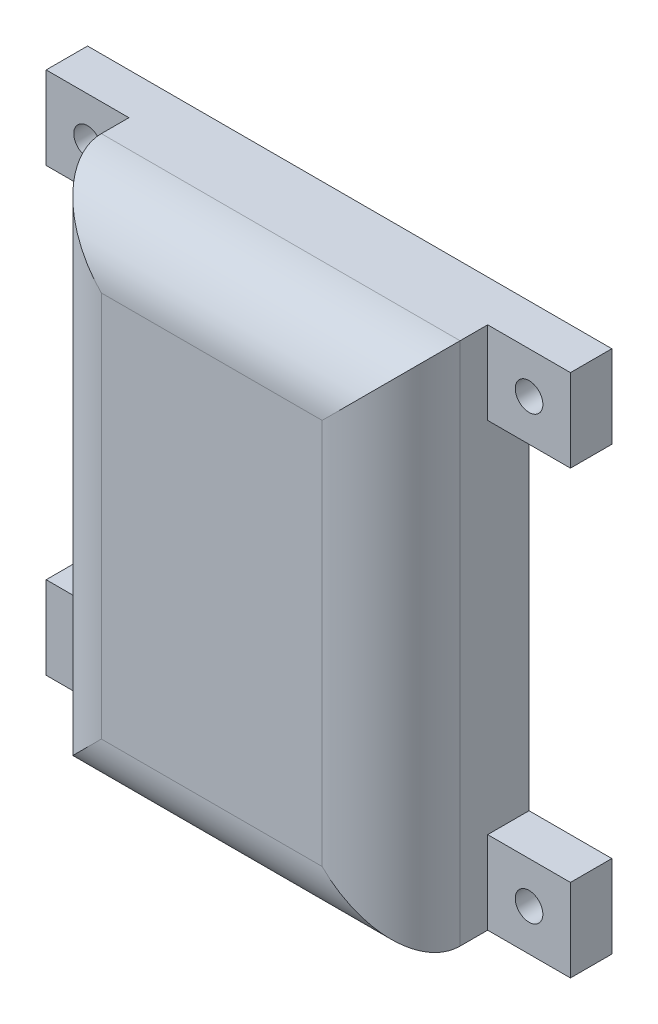
ISO-10303-21;
HEADER;
FILE_DESCRIPTION(('STEP AP214'),'2;1');
FILE_NAME('part.step','',(''),(''),'','','');
FILE_SCHEMA(('AUTOMOTIVE_DESIGN { 1 0 10303 214 1 1 1 1 }'));
ENDSEC;
DATA;
#1=APPLICATION_CONTEXT('core data for automotive mechanical design processes');
#2=APPLICATION_PROTOCOL_DEFINITION('international standard','automotive_design',2000,#1);
#3=PRODUCT_CONTEXT('',#1,'mechanical');
#4=PRODUCT('Part','Part','',(#3));
#5=PRODUCT_RELATED_PRODUCT_CATEGORY('part','',(#4));
#6=PRODUCT_DEFINITION_FORMATION('','',#4);
#7=PRODUCT_DEFINITION_CONTEXT('part definition',#1,'design');
#8=PRODUCT_DEFINITION('design','',#6,#7);
#9=PRODUCT_DEFINITION_SHAPE('','',#8);
#10=(LENGTH_UNIT() NAMED_UNIT(*) SI_UNIT(.MILLI.,.METRE.));
#11=(NAMED_UNIT(*) PLANE_ANGLE_UNIT() SI_UNIT($,.RADIAN.));
#12=(NAMED_UNIT(*) SI_UNIT($,.STERADIAN.) SOLID_ANGLE_UNIT());
#13=UNCERTAINTY_MEASURE_WITH_UNIT(LENGTH_MEASURE(1.E-05),#10,'distance_accuracy_value','');
#14=(GEOMETRIC_REPRESENTATION_CONTEXT(3) GLOBAL_UNCERTAINTY_ASSIGNED_CONTEXT((#13)) GLOBAL_UNIT_ASSIGNED_CONTEXT((#10,
#11,#12)) REPRESENTATION_CONTEXT('',''));
#15=CARTESIAN_POINT('',(0.,0.,0.));
#16=DIRECTION('',(0.,0.,1.));
#17=DIRECTION('',(1.,0.,0.));
#18=AXIS2_PLACEMENT_3D('',#15,#16,#17);
#19=CARTESIAN_POINT('',(-13.,19.,0.));
#20=DIRECTION('',(0.,0.,1.));
#21=DIRECTION('',(1.,0.,0.));
#22=AXIS2_PLACEMENT_3D('',#19,#20,#21);
#23=PLANE('',#22);
#24=CARTESIAN_POINT('',(16.,-16.,0.));
#25=DIRECTION('',(0.,0.,1.));
#26=DIRECTION('',(1.,0.,0.));
#27=AXIS2_PLACEMENT_3D('',#24,#25,#26);
#28=CIRCLE('',#27,1.00000000000001);
#29=CARTESIAN_POINT('',(17.,-16.,0.));
#30=VERTEX_POINT('',#29);
#31=EDGE_CURVE('E494',#30,#30,#28,.T.);
#32=ORIENTED_EDGE('',*,*,#31,.T.);
#33=EDGE_LOOP('',(#32));
#34=FACE_BOUND('',#33,.T.);
#35=CARTESIAN_POINT('',(-16.,16.,0.));
#36=DIRECTION('',(0.,0.,1.));
#37=DIRECTION('',(1.,0.,0.));
#38=AXIS2_PLACEMENT_3D('',#35,#36,#37);
#39=CIRCLE('',#38,1.);
#40=CARTESIAN_POINT('',(-15.,16.,0.));
#41=VERTEX_POINT('',#40);
#42=EDGE_CURVE('E500',#41,#41,#39,.T.);
#43=ORIENTED_EDGE('',*,*,#42,.T.);
#44=EDGE_LOOP('',(#43));
#45=FACE_BOUND('',#44,.T.);
#46=DIRECTION('',(0.,-1.,0.));
#47=VECTOR('',#46,1.);
#48=CARTESIAN_POINT('',(-13.,-19.,0.));
#49=LINE('',#48,#47);
#50=CARTESIAN_POINT('',(-13.,13.,0.));
#51=VERTEX_POINT('',#50);
#52=CARTESIAN_POINT('',(-13.,-13.,0.));
#53=VERTEX_POINT('',#52);
#54=EDGE_CURVE('E246',#51,#53,#49,.T.);
#55=ORIENTED_EDGE('',*,*,#54,.F.);
#56=DIRECTION('',(1.,0.,0.));
#57=VECTOR('',#56,1.);
#58=CARTESIAN_POINT('',(-13.,13.,0.));
#59=LINE('',#58,#57);
#60=CARTESIAN_POINT('',(-19.,13.,0.));
#61=VERTEX_POINT('',#60);
#62=EDGE_CURVE('E213',#61,#51,#59,.T.);
#63=ORIENTED_EDGE('',*,*,#62,.F.);
#64=DIRECTION('',(0.,-1.,0.));
#65=VECTOR('',#64,1.);
#66=CARTESIAN_POINT('',(-19.,19.,0.));
#67=LINE('',#66,#65);
#68=CARTESIAN_POINT('',(-19.,19.,0.));
#69=VERTEX_POINT('',#68);
#70=EDGE_CURVE('E211',#69,#61,#67,.T.);
#71=ORIENTED_EDGE('',*,*,#70,.F.);
#72=DIRECTION('',(-1.,0.,0.));
#73=VECTOR('',#72,1.);
#74=CARTESIAN_POINT('',(13.,19.,0.));
#75=LINE('',#74,#73);
#76=CARTESIAN_POINT('',(19.,19.,0.));
#77=VERTEX_POINT('',#76);
#78=EDGE_CURVE('E196',#77,#69,#75,.T.);
#79=ORIENTED_EDGE('',*,*,#78,.F.);
#80=DIRECTION('',(0.,1.,0.));
#81=VECTOR('',#80,1.);
#82=CARTESIAN_POINT('',(19.,19.,0.));
#83=LINE('',#82,#81);
#84=CARTESIAN_POINT('',(19.,13.,0.));
#85=VERTEX_POINT('',#84);
#86=EDGE_CURVE('E304',#85,#77,#83,.T.);
#87=ORIENTED_EDGE('',*,*,#86,.F.);
#88=DIRECTION('',(1.,0.,0.));
#89=VECTOR('',#88,1.);
#90=CARTESIAN_POINT('',(13.,13.,0.));
#91=LINE('',#90,#89);
#92=CARTESIAN_POINT('',(13.,13.,0.));
#93=VERTEX_POINT('',#92);
#94=EDGE_CURVE('E301',#93,#85,#91,.T.);
#95=ORIENTED_EDGE('',*,*,#94,.F.);
#96=DIRECTION('',(0.,1.,0.));
#97=VECTOR('',#96,1.);
#98=CARTESIAN_POINT('',(13.,-19.,0.));
#99=LINE('',#98,#97);
#100=CARTESIAN_POINT('',(13.,-13.,0.));
#101=VERTEX_POINT('',#100);
#102=EDGE_CURVE('E257',#101,#93,#99,.T.);
#103=ORIENTED_EDGE('',*,*,#102,.F.);
#104=DIRECTION('',(-1.,0.,0.));
#105=VECTOR('',#104,1.);
#106=CARTESIAN_POINT('',(13.,-13.,0.));
#107=LINE('',#106,#105);
#108=CARTESIAN_POINT('',(19.,-13.,0.));
#109=VERTEX_POINT('',#108);
#110=EDGE_CURVE('E774',#109,#101,#107,.T.);
#111=ORIENTED_EDGE('',*,*,#110,.F.);
#112=DIRECTION('',(0.,1.,0.));
#113=VECTOR('',#112,1.);
#114=CARTESIAN_POINT('',(19.,-19.,0.));
#115=LINE('',#114,#113);
#116=CARTESIAN_POINT('',(19.,-19.,0.));
#117=VERTEX_POINT('',#116);
#118=EDGE_CURVE('E243',#117,#109,#115,.T.);
#119=ORIENTED_EDGE('',*,*,#118,.F.);
#120=DIRECTION('',(1.,0.,0.));
#121=VECTOR('',#120,1.);
#122=CARTESIAN_POINT('',(13.,-19.,0.));
#123=LINE('',#122,#121);
#124=CARTESIAN_POINT('',(-19.,-19.,0.));
#125=VERTEX_POINT('',#124);
#126=EDGE_CURVE('E249',#125,#117,#123,.T.);
#127=ORIENTED_EDGE('',*,*,#126,.F.);
#128=DIRECTION('',(0.,-1.,0.));
#129=VECTOR('',#128,1.);
#130=CARTESIAN_POINT('',(-19.,-19.,0.));
#131=LINE('',#130,#129);
#132=CARTESIAN_POINT('',(-19.,-13.,0.));
#133=VERTEX_POINT('',#132);
#134=EDGE_CURVE('E225',#133,#125,#131,.T.);
#135=ORIENTED_EDGE('',*,*,#134,.F.);
#136=DIRECTION('',(-1.,0.,0.));
#137=VECTOR('',#136,1.);
#138=CARTESIAN_POINT('',(-13.,-13.,0.));
#139=LINE('',#138,#137);
#140=EDGE_CURVE('E199',#53,#133,#139,.T.);
#141=ORIENTED_EDGE('',*,*,#140,.F.);
#142=EDGE_LOOP('',(#55,#63,#71,#79,#87,#95,#103,#111,#119,#127,#135,#141));
#143=FACE_BOUND('',#142,.T.);
#144=DIRECTION('',(0.,-1.,0.));
#145=VECTOR('',#144,1.);
#146=CARTESIAN_POINT('',(-11.,-17.,0.));
#147=LINE('',#146,#145);
#148=CARTESIAN_POINT('',(-11.,17.,0.));
#149=VERTEX_POINT('',#148);
#150=CARTESIAN_POINT('',(-11.,-17.,0.));
#151=VERTEX_POINT('',#150);
#152=EDGE_CURVE('E335',#149,#151,#147,.T.);
#153=ORIENTED_EDGE('',*,*,#152,.T.);
#154=DIRECTION('',(1.,0.,0.));
#155=VECTOR('',#154,1.);
#156=CARTESIAN_POINT('',(11.,-17.,0.));
#157=LINE('',#156,#155);
#158=CARTESIAN_POINT('',(11.,-17.,0.));
#159=VERTEX_POINT('',#158);
#160=EDGE_CURVE('E338',#151,#159,#157,.T.);
#161=ORIENTED_EDGE('',*,*,#160,.T.);
#162=DIRECTION('',(0.,1.,0.));
#163=VECTOR('',#162,1.);
#164=CARTESIAN_POINT('',(11.,-17.,0.));
#165=LINE('',#164,#163);
#166=CARTESIAN_POINT('',(11.,17.,0.));
#167=VERTEX_POINT('',#166);
#168=EDGE_CURVE('E341',#159,#167,#165,.T.);
#169=ORIENTED_EDGE('',*,*,#168,.T.);
#170=DIRECTION('',(-1.,0.,0.));
#171=VECTOR('',#170,1.);
#172=CARTESIAN_POINT('',(11.,17.,0.));
#173=LINE('',#172,#171);
#174=EDGE_CURVE('E328',#167,#149,#173,.T.);
#175=ORIENTED_EDGE('',*,*,#174,.T.);
#176=EDGE_LOOP('',(#153,#161,#169,#175));
#177=FACE_BOUND('',#176,.T.);
#178=CARTESIAN_POINT('',(-16.,-16.,0.));
#179=DIRECTION('',(0.,0.,1.));
#180=DIRECTION('',(1.,0.,0.));
#181=AXIS2_PLACEMENT_3D('',#178,#179,#180);
#182=CIRCLE('',#181,1.);
#183=CARTESIAN_POINT('',(-15.,-16.,0.));
#184=VERTEX_POINT('',#183);
#185=EDGE_CURVE('E497',#184,#184,#182,.T.);
#186=ORIENTED_EDGE('',*,*,#185,.T.);
#187=EDGE_LOOP('',(#186));
#188=FACE_BOUND('',#187,.T.);
#189=CARTESIAN_POINT('',(16.,16.,0.));
#190=DIRECTION('',(0.,0.,1.));
#191=DIRECTION('',(1.,0.,0.));
#192=AXIS2_PLACEMENT_3D('',#189,#190,#191);
#193=CIRCLE('',#192,1.);
#194=CARTESIAN_POINT('',(17.,16.,0.));
#195=VERTEX_POINT('',#194);
#196=EDGE_CURVE('E428',#195,#195,#193,.T.);
#197=ORIENTED_EDGE('',*,*,#196,.T.);
#198=EDGE_LOOP('',(#197));
#199=FACE_BOUND('',#198,.T.);
#200=ADVANCED_FACE('F31',(#34,#45,#143,#177,#188,#199),#23,.F.);
#201=CARTESIAN_POINT('',(13.,13.,3.));
#202=DIRECTION('',(0.,0.,1.));
#203=DIRECTION('',(1.,0.,0.));
#204=AXIS2_PLACEMENT_3D('',#201,#202,#203);
#205=PLANE('',#204);
#206=DIRECTION('',(0.,-1.,0.));
#207=VECTOR('',#206,1.);
#208=CARTESIAN_POINT('',(13.,19.,3.));
#209=LINE('',#208,#207);
#210=CARTESIAN_POINT('',(13.,19.,3.));
#211=VERTEX_POINT('',#210);
#212=CARTESIAN_POINT('',(13.,13.,3.));
#213=VERTEX_POINT('',#212);
#214=EDGE_CURVE('E313',#211,#213,#209,.T.);
#215=ORIENTED_EDGE('',*,*,#214,.T.);
#216=DIRECTION('',(1.,0.,0.));
#217=VECTOR('',#216,1.);
#218=CARTESIAN_POINT('',(13.,13.,3.));
#219=LINE('',#218,#217);
#220=CARTESIAN_POINT('',(19.,13.,3.));
#221=VERTEX_POINT('',#220);
#222=EDGE_CURVE('E310',#213,#221,#219,.T.);
#223=ORIENTED_EDGE('',*,*,#222,.T.);
#224=DIRECTION('',(0.,1.,0.));
#225=VECTOR('',#224,1.);
#226=CARTESIAN_POINT('',(19.,19.,3.));
#227=LINE('',#226,#225);
#228=CARTESIAN_POINT('',(19.,19.,3.));
#229=VERTEX_POINT('',#228);
#230=EDGE_CURVE('E312',#221,#229,#227,.T.);
#231=ORIENTED_EDGE('',*,*,#230,.T.);
#232=DIRECTION('',(-1.,0.,0.));
#233=VECTOR('',#232,1.);
#234=CARTESIAN_POINT('',(13.,19.,3.));
#235=LINE('',#234,#233);
#236=EDGE_CURVE('E315',#229,#211,#235,.T.);
#237=ORIENTED_EDGE('',*,*,#236,.T.);
#238=EDGE_LOOP('',(#215,#223,#231,#237));
#239=FACE_BOUND('',#238,.T.);
#240=CARTESIAN_POINT('',(16.,16.,3.));
#241=DIRECTION('',(0.,0.,1.));
#242=DIRECTION('',(1.,0.,0.));
#243=AXIS2_PLACEMENT_3D('',#240,#241,#242);
#244=CIRCLE('',#243,1.);
#245=CARTESIAN_POINT('',(17.,16.,3.));
#246=VERTEX_POINT('',#245);
#247=EDGE_CURVE('E431',#246,#246,#244,.F.);
#248=ORIENTED_EDGE('',*,*,#247,.T.);
#249=EDGE_LOOP('',(#248));
#250=FACE_BOUND('',#249,.T.);
#251=ADVANCED_FACE('F380',(#239,#250),#205,.T.);
#252=CARTESIAN_POINT('',(13.,-13.,3.));
#253=DIRECTION('',(0.,0.,-1.));
#254=DIRECTION('',(-1.,0.,0.));
#255=AXIS2_PLACEMENT_3D('',#252,#253,#254);
#256=PLANE('',#255);
#257=DIRECTION('',(0.,-1.,0.));
#258=VECTOR('',#257,1.);
#259=CARTESIAN_POINT('',(13.,-19.,3.));
#260=LINE('',#259,#258);
#261=CARTESIAN_POINT('',(13.,-13.,3.));
#262=VERTEX_POINT('',#261);
#263=CARTESIAN_POINT('',(13.,-19.,3.));
#264=VERTEX_POINT('',#263);
#265=EDGE_CURVE('E237',#262,#264,#260,.T.);
#266=ORIENTED_EDGE('',*,*,#265,.T.);
#267=DIRECTION('',(1.,0.,0.));
#268=VECTOR('',#267,1.);
#269=CARTESIAN_POINT('',(13.,-19.,3.));
#270=LINE('',#269,#268);
#271=CARTESIAN_POINT('',(19.,-19.,3.));
#272=VERTEX_POINT('',#271);
#273=EDGE_CURVE('E769',#264,#272,#270,.T.);
#274=ORIENTED_EDGE('',*,*,#273,.T.);
#275=DIRECTION('',(0.,1.,0.));
#276=VECTOR('',#275,1.);
#277=CARTESIAN_POINT('',(19.,-19.,3.));
#278=LINE('',#277,#276);
#279=CARTESIAN_POINT('',(19.,-13.,3.));
#280=VERTEX_POINT('',#279);
#281=EDGE_CURVE('E300',#272,#280,#278,.T.);
#282=ORIENTED_EDGE('',*,*,#281,.T.);
#283=DIRECTION('',(-1.,0.,0.));
#284=VECTOR('',#283,1.);
#285=CARTESIAN_POINT('',(13.,-13.,3.));
#286=LINE('',#285,#284);
#287=EDGE_CURVE('E772',#280,#262,#286,.T.);
#288=ORIENTED_EDGE('',*,*,#287,.T.);
#289=EDGE_LOOP('',(#266,#274,#282,#288));
#290=FACE_BOUND('',#289,.T.);
#291=CARTESIAN_POINT('',(16.,-16.,3.));
#292=DIRECTION('',(0.,0.,-1.));
#293=DIRECTION('',(-1.,0.,0.));
#294=AXIS2_PLACEMENT_3D('',#291,#292,#293);
#295=CIRCLE('',#294,1.00000000000001);
#296=CARTESIAN_POINT('',(15.,-16.,3.));
#297=VERTEX_POINT('',#296);
#298=EDGE_CURVE('E495',#297,#297,#295,.F.);
#299=ORIENTED_EDGE('',*,*,#298,.F.);
#300=EDGE_LOOP('',(#299));
#301=FACE_BOUND('',#300,.T.);
#302=ADVANCED_FACE('F386',(#290,#301),#256,.F.);
#303=CARTESIAN_POINT('',(-13.,-13.,3.));
#304=DIRECTION('',(0.,0.,1.));
#305=DIRECTION('',(1.,0.,0.));
#306=AXIS2_PLACEMENT_3D('',#303,#304,#305);
#307=PLANE('',#306);
#308=DIRECTION('',(0.,1.,0.));
#309=VECTOR('',#308,1.);
#310=CARTESIAN_POINT('',(-13.,-19.,3.));
#311=LINE('',#310,#309);
#312=CARTESIAN_POINT('',(-13.,-19.,3.));
#313=VERTEX_POINT('',#312);
#314=CARTESIAN_POINT('',(-13.,-13.,3.));
#315=VERTEX_POINT('',#314);
#316=EDGE_CURVE('E222',#313,#315,#311,.T.);
#317=ORIENTED_EDGE('',*,*,#316,.T.);
#318=DIRECTION('',(-1.,0.,0.));
#319=VECTOR('',#318,1.);
#320=CARTESIAN_POINT('',(-13.,-13.,3.));
#321=LINE('',#320,#319);
#322=CARTESIAN_POINT('',(-19.,-13.,3.));
#323=VERTEX_POINT('',#322);
#324=EDGE_CURVE('E219',#315,#323,#321,.T.);
#325=ORIENTED_EDGE('',*,*,#324,.T.);
#326=DIRECTION('',(0.,-1.,0.));
#327=VECTOR('',#326,1.);
#328=CARTESIAN_POINT('',(-19.,-19.,3.));
#329=LINE('',#328,#327);
#330=CARTESIAN_POINT('',(-19.,-19.,3.));
#331=VERTEX_POINT('',#330);
#332=EDGE_CURVE('E221',#323,#331,#329,.T.);
#333=ORIENTED_EDGE('',*,*,#332,.T.);
#334=DIRECTION('',(1.,0.,0.));
#335=VECTOR('',#334,1.);
#336=CARTESIAN_POINT('',(-13.,-19.,3.));
#337=LINE('',#336,#335);
#338=EDGE_CURVE('E224',#331,#313,#337,.T.);
#339=ORIENTED_EDGE('',*,*,#338,.T.);
#340=EDGE_LOOP('',(#317,#325,#333,#339));
#341=FACE_BOUND('',#340,.T.);
#342=CARTESIAN_POINT('',(-16.,-16.,3.));
#343=DIRECTION('',(0.,0.,1.));
#344=DIRECTION('',(1.,0.,0.));
#345=AXIS2_PLACEMENT_3D('',#342,#343,#344);
#346=CIRCLE('',#345,1.);
#347=CARTESIAN_POINT('',(-15.,-16.,3.));
#348=VERTEX_POINT('',#347);
#349=EDGE_CURVE('E498',#348,#348,#346,.F.);
#350=ORIENTED_EDGE('',*,*,#349,.T.);
#351=EDGE_LOOP('',(#350));
#352=FACE_BOUND('',#351,.T.);
#353=ADVANCED_FACE('F519',(#341,#352),#307,.T.);
#354=CARTESIAN_POINT('',(-13.,13.,3.));
#355=DIRECTION('',(0.,0.,-1.));
#356=DIRECTION('',(-1.,0.,0.));
#357=AXIS2_PLACEMENT_3D('',#354,#355,#356);
#358=PLANE('',#357);
#359=DIRECTION('',(0.,1.,0.));
#360=VECTOR('',#359,1.);
#361=CARTESIAN_POINT('',(-13.,19.,3.));
#362=LINE('',#361,#360);
#363=CARTESIAN_POINT('',(-13.,13.,3.));
#364=VERTEX_POINT('',#363);
#365=CARTESIAN_POINT('',(-13.,19.,3.));
#366=VERTEX_POINT('',#365);
#367=EDGE_CURVE('E189',#364,#366,#362,.T.);
#368=ORIENTED_EDGE('',*,*,#367,.T.);
#369=DIRECTION('',(-1.,0.,0.));
#370=VECTOR('',#369,1.);
#371=CARTESIAN_POINT('',(-13.,19.,3.));
#372=LINE('',#371,#370);
#373=CARTESIAN_POINT('',(-19.,19.,3.));
#374=VERTEX_POINT('',#373);
#375=EDGE_CURVE('E181',#366,#374,#372,.T.);
#376=ORIENTED_EDGE('',*,*,#375,.T.);
#377=DIRECTION('',(0.,-1.,0.));
#378=VECTOR('',#377,1.);
#379=CARTESIAN_POINT('',(-19.,19.,3.));
#380=LINE('',#379,#378);
#381=CARTESIAN_POINT('',(-19.,13.,3.));
#382=VERTEX_POINT('',#381);
#383=EDGE_CURVE('E187',#374,#382,#380,.T.);
#384=ORIENTED_EDGE('',*,*,#383,.T.);
#385=DIRECTION('',(1.,0.,0.));
#386=VECTOR('',#385,1.);
#387=CARTESIAN_POINT('',(-13.,13.,3.));
#388=LINE('',#387,#386);
#389=EDGE_CURVE('E205',#382,#364,#388,.T.);
#390=ORIENTED_EDGE('',*,*,#389,.T.);
#391=EDGE_LOOP('',(#368,#376,#384,#390));
#392=FACE_BOUND('',#391,.T.);
#393=CARTESIAN_POINT('',(-16.,16.,3.));
#394=DIRECTION('',(0.,0.,-1.));
#395=DIRECTION('',(-1.,0.,0.));
#396=AXIS2_PLACEMENT_3D('',#393,#394,#395);
#397=CIRCLE('',#396,1.);
#398=CARTESIAN_POINT('',(-17.,16.,3.));
#399=VERTEX_POINT('',#398);
#400=EDGE_CURVE('E214',#399,#399,#397,.F.);
#401=ORIENTED_EDGE('',*,*,#400,.F.);
#402=EDGE_LOOP('',(#401));
#403=FACE_BOUND('',#402,.T.);
#404=ADVANCED_FACE('F183',(#392,#403),#358,.F.);
#405=CARTESIAN_POINT('',(-13.,-19.,10.));
#406=DIRECTION('',(1.,0.,0.));
#407=DIRECTION('',(0.,0.,-1.));
#408=AXIS2_PLACEMENT_3D('',#405,#406,#407);
#409=PLANE('',#408);
#410=DIRECTION('',(0.,0.,-1.));
#411=VECTOR('',#410,1.);
#412=CARTESIAN_POINT('',(-13.,-19.,10.));
#413=LINE('',#412,#411);
#414=CARTESIAN_POINT('',(-13.,-19.,5.));
#415=VERTEX_POINT('',#414);
#416=EDGE_CURVE('E445',#415,#313,#413,.T.);
#417=ORIENTED_EDGE('',*,*,#416,.F.);
#418=DIRECTION('',(0.,-1.,0.));
#419=VECTOR('',#418,1.);
#420=CARTESIAN_POINT('',(-13.,19.,5.));
#421=LINE('',#420,#419);
#422=CARTESIAN_POINT('',(-13.,19.,5.));
#423=VERTEX_POINT('',#422);
#424=EDGE_CURVE('E48',#415,#423,#421,.F.);
#425=ORIENTED_EDGE('',*,*,#424,.T.);
#426=DIRECTION('',(0.,0.,-1.));
#427=VECTOR('',#426,1.);
#428=CARTESIAN_POINT('',(-13.,19.,10.));
#429=LINE('',#428,#427);
#430=EDGE_CURVE('E470',#423,#366,#429,.T.);
#431=ORIENTED_EDGE('',*,*,#430,.T.);
#432=ORIENTED_EDGE('',*,*,#367,.F.);
#433=DIRECTION('',(0.,0.,-1.));
#434=VECTOR('',#433,1.);
#435=CARTESIAN_POINT('',(-13.,13.,3.));
#436=LINE('',#435,#434);
#437=EDGE_CURVE('E207',#364,#51,#436,.T.);
#438=ORIENTED_EDGE('',*,*,#437,.T.);
#439=ORIENTED_EDGE('',*,*,#54,.T.);
#440=DIRECTION('',(0.,0.,-1.));
#441=VECTOR('',#440,1.);
#442=CARTESIAN_POINT('',(-13.,-13.,3.));
#443=LINE('',#442,#441);
#444=EDGE_CURVE('E234',#315,#53,#443,.T.);
#445=ORIENTED_EDGE('',*,*,#444,.F.);
#446=ORIENTED_EDGE('',*,*,#316,.F.);
#447=EDGE_LOOP('',(#417,#425,#431,#432,#438,#439,#445,#446));
#448=FACE_BOUND('',#447,.T.);
#449=ADVANCED_FACE('F400',(#448),#409,.F.);
#450=CARTESIAN_POINT('',(13.,-19.,10.));
#451=DIRECTION('',(-1.,0.,0.));
#452=DIRECTION('',(0.,0.,1.));
#453=AXIS2_PLACEMENT_3D('',#450,#451,#452);
#454=PLANE('',#453);
#455=DIRECTION('',(0.,0.,-1.));
#456=VECTOR('',#455,1.);
#457=CARTESIAN_POINT('',(13.,19.,10.));
#458=LINE('',#457,#456);
#459=CARTESIAN_POINT('',(13.,19.,5.));
#460=VERTEX_POINT('',#459);
#461=EDGE_CURVE('E468',#460,#211,#458,.T.);
#462=ORIENTED_EDGE('',*,*,#461,.F.);
#463=DIRECTION('',(0.,1.,0.));
#464=VECTOR('',#463,1.);
#465=CARTESIAN_POINT('',(13.,-19.,5.));
#466=LINE('',#465,#464);
#467=CARTESIAN_POINT('',(13.,-19.,5.));
#468=VERTEX_POINT('',#467);
#469=EDGE_CURVE('E444',#460,#468,#466,.F.);
#470=ORIENTED_EDGE('',*,*,#469,.T.);
#471=DIRECTION('',(0.,0.,-1.));
#472=VECTOR('',#471,1.);
#473=CARTESIAN_POINT('',(13.,-19.,10.));
#474=LINE('',#473,#472);
#475=EDGE_CURVE('E448',#468,#264,#474,.T.);
#476=ORIENTED_EDGE('',*,*,#475,.T.);
#477=ORIENTED_EDGE('',*,*,#265,.F.);
#478=DIRECTION('',(0.,0.,-1.));
#479=VECTOR('',#478,1.);
#480=CARTESIAN_POINT('',(13.,-13.,3.));
#481=LINE('',#480,#479);
#482=EDGE_CURVE('E306',#262,#101,#481,.T.);
#483=ORIENTED_EDGE('',*,*,#482,.T.);
#484=ORIENTED_EDGE('',*,*,#102,.T.);
#485=DIRECTION('',(0.,0.,-1.));
#486=VECTOR('',#485,1.);
#487=CARTESIAN_POINT('',(13.,13.,3.));
#488=LINE('',#487,#486);
#489=EDGE_CURVE('E264',#213,#93,#488,.T.);
#490=ORIENTED_EDGE('',*,*,#489,.F.);
#491=ORIENTED_EDGE('',*,*,#214,.F.);
#492=EDGE_LOOP('',(#462,#470,#476,#477,#483,#484,#490,#491));
#493=FACE_BOUND('',#492,.T.);
#494=ADVANCED_FACE('F397',(#493),#454,.F.);
#495=CARTESIAN_POINT('',(13.,-19.,10.));
#496=DIRECTION('',(0.,1.,0.));
#497=DIRECTION('',(-1.,0.,0.));
#498=AXIS2_PLACEMENT_3D('',#495,#496,#497);
#499=PLANE('',#498);
#500=ORIENTED_EDGE('',*,*,#475,.F.);
#501=DIRECTION('',(1.,0.,0.));
#502=VECTOR('',#501,1.);
#503=CARTESIAN_POINT('',(-13.,-19.,5.));
#504=LINE('',#503,#502);
#505=EDGE_CURVE('E11',#468,#415,#504,.F.);
#506=ORIENTED_EDGE('',*,*,#505,.T.);
#507=ORIENTED_EDGE('',*,*,#416,.T.);
#508=ORIENTED_EDGE('',*,*,#338,.F.);
#509=DIRECTION('',(0.,0.,-1.));
#510=VECTOR('',#509,1.);
#511=CARTESIAN_POINT('',(-19.,-19.,3.));
#512=LINE('',#511,#510);
#513=EDGE_CURVE('E228',#331,#125,#512,.T.);
#514=ORIENTED_EDGE('',*,*,#513,.T.);
#515=ORIENTED_EDGE('',*,*,#126,.T.);
#516=DIRECTION('',(0.,0.,-1.));
#517=VECTOR('',#516,1.);
#518=CARTESIAN_POINT('',(19.,-19.,3.));
#519=LINE('',#518,#517);
#520=EDGE_CURVE('E293',#272,#117,#519,.T.);
#521=ORIENTED_EDGE('',*,*,#520,.F.);
#522=ORIENTED_EDGE('',*,*,#273,.F.);
#523=EDGE_LOOP('',(#500,#506,#507,#508,#514,#515,#521,#522));
#524=FACE_BOUND('',#523,.T.);
#525=ADVANCED_FACE('F291',(#524),#499,.F.);
#526=CARTESIAN_POINT('',(13.,19.,10.));
#527=DIRECTION('',(0.,-1.,0.));
#528=DIRECTION('',(0.,0.,-1.));
#529=AXIS2_PLACEMENT_3D('',#526,#527,#528);
#530=PLANE('',#529);
#531=ORIENTED_EDGE('',*,*,#430,.F.);
#532=DIRECTION('',(-1.,0.,0.));
#533=VECTOR('',#532,1.);
#534=CARTESIAN_POINT('',(13.,19.,5.));
#535=LINE('',#534,#533);
#536=EDGE_CURVE('E40',#423,#460,#535,.F.);
#537=ORIENTED_EDGE('',*,*,#536,.T.);
#538=ORIENTED_EDGE('',*,*,#461,.T.);
#539=ORIENTED_EDGE('',*,*,#236,.F.);
#540=DIRECTION('',(0.,0.,-1.));
#541=VECTOR('',#540,1.);
#542=CARTESIAN_POINT('',(19.,19.,3.));
#543=LINE('',#542,#541);
#544=EDGE_CURVE('E318',#229,#77,#543,.T.);
#545=ORIENTED_EDGE('',*,*,#544,.T.);
#546=ORIENTED_EDGE('',*,*,#78,.T.);
#547=DIRECTION('',(0.,0.,-1.));
#548=VECTOR('',#547,1.);
#549=CARTESIAN_POINT('',(-19.,19.,3.));
#550=LINE('',#549,#548);
#551=EDGE_CURVE('E193',#374,#69,#550,.T.);
#552=ORIENTED_EDGE('',*,*,#551,.F.);
#553=ORIENTED_EDGE('',*,*,#375,.F.);
#554=EDGE_LOOP('',(#531,#537,#538,#539,#545,#546,#552,#553));
#555=FACE_BOUND('',#554,.T.);
#556=ADVANCED_FACE('F194',(#555),#530,.F.);
#557=CARTESIAN_POINT('',(-13.,19.,10.));
#558=DIRECTION('',(0.,0.,1.));
#559=DIRECTION('',(1.,0.,0.));
#560=AXIS2_PLACEMENT_3D('',#557,#558,#559);
#561=PLANE('',#560);
#562=DIRECTION('',(0.,1.,0.));
#563=VECTOR('',#562,1.);
#564=CARTESIAN_POINT('',(8.,19.,10.));
#565=LINE('',#564,#563);
#566=CARTESIAN_POINT('',(8.,-14.,10.));
#567=VERTEX_POINT('',#566);
#568=CARTESIAN_POINT('',(8.,14.,10.));
#569=VERTEX_POINT('',#568);
#570=EDGE_CURVE('E486',#567,#569,#565,.T.);
#571=ORIENTED_EDGE('',*,*,#570,.T.);
#572=DIRECTION('',(-1.,0.,0.));
#573=VECTOR('',#572,1.);
#574=CARTESIAN_POINT('',(-13.,14.,10.));
#575=LINE('',#574,#573);
#576=CARTESIAN_POINT('',(-8.,14.,10.));
#577=VERTEX_POINT('',#576);
#578=EDGE_CURVE('E484',#569,#577,#575,.T.);
#579=ORIENTED_EDGE('',*,*,#578,.T.);
#580=DIRECTION('',(0.,-1.,0.));
#581=VECTOR('',#580,1.);
#582=CARTESIAN_POINT('',(-8.,-19.,10.));
#583=LINE('',#582,#581);
#584=CARTESIAN_POINT('',(-8.,-14.,10.));
#585=VERTEX_POINT('',#584);
#586=EDGE_CURVE('E489',#577,#585,#583,.T.);
#587=ORIENTED_EDGE('',*,*,#586,.T.);
#588=DIRECTION('',(1.,0.,0.));
#589=VECTOR('',#588,1.);
#590=CARTESIAN_POINT('',(13.,-14.,10.));
#591=LINE('',#590,#589);
#592=EDGE_CURVE('E426',#585,#567,#591,.T.);
#593=ORIENTED_EDGE('',*,*,#592,.T.);
#594=EDGE_LOOP('',(#571,#579,#587,#593));
#595=FACE_BOUND('',#594,.T.);
#596=ADVANCED_FACE('F393',(#595),#561,.T.);
#597=CARTESIAN_POINT('',(-11.,-17.,8.));
#598=DIRECTION('',(1.,0.,0.));
#599=DIRECTION('',(0.,0.,-1.));
#600=AXIS2_PLACEMENT_3D('',#597,#598,#599);
#601=PLANE('',#600);
#602=ORIENTED_EDGE('',*,*,#152,.F.);
#603=DIRECTION('',(0.,0.,-1.));
#604=VECTOR('',#603,1.);
#605=CARTESIAN_POINT('',(-11.,17.,8.));
#606=LINE('',#605,#604);
#607=CARTESIAN_POINT('',(-11.,17.,8.));
#608=VERTEX_POINT('',#607);
#609=EDGE_CURVE('E334',#608,#149,#606,.T.);
#610=ORIENTED_EDGE('',*,*,#609,.F.);
#611=DIRECTION('',(0.,-1.,0.));
#612=VECTOR('',#611,1.);
#613=CARTESIAN_POINT('',(-11.,-17.,8.));
#614=LINE('',#613,#612);
#615=CARTESIAN_POINT('',(-11.,-17.,8.));
#616=VERTEX_POINT('',#615);
#617=EDGE_CURVE('E324',#608,#616,#614,.T.);
#618=ORIENTED_EDGE('',*,*,#617,.T.);
#619=DIRECTION('',(0.,0.,-1.));
#620=VECTOR('',#619,1.);
#621=CARTESIAN_POINT('',(-11.,-17.,8.));
#622=LINE('',#621,#620);
#623=EDGE_CURVE('E250',#616,#151,#622,.T.);
#624=ORIENTED_EDGE('',*,*,#623,.T.);
#625=EDGE_LOOP('',(#602,#610,#618,#624));
#626=FACE_BOUND('',#625,.T.);
#627=ADVANCED_FACE('F356',(#626),#601,.T.);
#628=CARTESIAN_POINT('',(11.,-17.,8.));
#629=DIRECTION('',(0.,1.,0.));
#630=DIRECTION('',(-1.,0.,0.));
#631=AXIS2_PLACEMENT_3D('',#628,#629,#630);
#632=PLANE('',#631);
#633=ORIENTED_EDGE('',*,*,#160,.F.);
#634=ORIENTED_EDGE('',*,*,#623,.F.);
#635=DIRECTION('',(1.,0.,0.));
#636=VECTOR('',#635,1.);
#637=CARTESIAN_POINT('',(11.,-17.,8.));
#638=LINE('',#637,#636);
#639=CARTESIAN_POINT('',(11.,-17.,8.));
#640=VERTEX_POINT('',#639);
#641=EDGE_CURVE('E327',#616,#640,#638,.T.);
#642=ORIENTED_EDGE('',*,*,#641,.T.);
#643=DIRECTION('',(0.,0.,-1.));
#644=VECTOR('',#643,1.);
#645=CARTESIAN_POINT('',(11.,-17.,8.));
#646=LINE('',#645,#644);
#647=EDGE_CURVE('E349',#640,#159,#646,.T.);
#648=ORIENTED_EDGE('',*,*,#647,.T.);
#649=EDGE_LOOP('',(#633,#634,#642,#648));
#650=FACE_BOUND('',#649,.T.);
#651=ADVANCED_FACE('F368',(#650),#632,.T.);
#652=CARTESIAN_POINT('',(11.,-17.,8.));
#653=DIRECTION('',(-1.,0.,0.));
#654=DIRECTION('',(0.,0.,1.));
#655=AXIS2_PLACEMENT_3D('',#652,#653,#654);
#656=PLANE('',#655);
#657=ORIENTED_EDGE('',*,*,#168,.F.);
#658=ORIENTED_EDGE('',*,*,#647,.F.);
#659=DIRECTION('',(0.,1.,0.));
#660=VECTOR('',#659,1.);
#661=CARTESIAN_POINT('',(11.,-17.,8.));
#662=LINE('',#661,#660);
#663=CARTESIAN_POINT('',(11.,17.,8.));
#664=VERTEX_POINT('',#663);
#665=EDGE_CURVE('E330',#640,#664,#662,.T.);
#666=ORIENTED_EDGE('',*,*,#665,.T.);
#667=DIRECTION('',(0.,0.,-1.));
#668=VECTOR('',#667,1.);
#669=CARTESIAN_POINT('',(11.,17.,8.));
#670=LINE('',#669,#668);
#671=EDGE_CURVE('E348',#664,#167,#670,.T.);
#672=ORIENTED_EDGE('',*,*,#671,.T.);
#673=EDGE_LOOP('',(#657,#658,#666,#672));
#674=FACE_BOUND('',#673,.T.);
#675=ADVANCED_FACE('F370',(#674),#656,.T.);
#676=CARTESIAN_POINT('',(11.,17.,8.));
#677=DIRECTION('',(0.,-1.,0.));
#678=DIRECTION('',(0.,0.,-1.));
#679=AXIS2_PLACEMENT_3D('',#676,#677,#678);
#680=PLANE('',#679);
#681=ORIENTED_EDGE('',*,*,#174,.F.);
#682=ORIENTED_EDGE('',*,*,#671,.F.);
#683=DIRECTION('',(-1.,0.,0.));
#684=VECTOR('',#683,1.);
#685=CARTESIAN_POINT('',(11.,17.,8.));
#686=LINE('',#685,#684);
#687=EDGE_CURVE('E332',#664,#608,#686,.T.);
#688=ORIENTED_EDGE('',*,*,#687,.T.);
#689=ORIENTED_EDGE('',*,*,#609,.T.);
#690=EDGE_LOOP('',(#681,#682,#688,#689));
#691=FACE_BOUND('',#690,.T.);
#692=ADVANCED_FACE('F363',(#691),#680,.T.);
#693=CARTESIAN_POINT('',(-11.,17.,8.));
#694=DIRECTION('',(0.,0.,1.));
#695=DIRECTION('',(1.,0.,0.));
#696=AXIS2_PLACEMENT_3D('',#693,#694,#695);
#697=PLANE('',#696);
#698=ORIENTED_EDGE('',*,*,#617,.F.);
#699=ORIENTED_EDGE('',*,*,#687,.F.);
#700=ORIENTED_EDGE('',*,*,#665,.F.);
#701=ORIENTED_EDGE('',*,*,#641,.F.);
#702=EDGE_LOOP('',(#698,#699,#700,#701));
#703=FACE_BOUND('',#702,.T.);
#704=ADVANCED_FACE('F366',(#703),#697,.F.);
#705=CARTESIAN_POINT('',(13.,13.,3.));
#706=DIRECTION('',(0.,1.,0.));
#707=DIRECTION('',(-1.,0.,0.));
#708=AXIS2_PLACEMENT_3D('',#705,#706,#707);
#709=PLANE('',#708);
#710=ORIENTED_EDGE('',*,*,#94,.T.);
#711=DIRECTION('',(0.,0.,-1.));
#712=VECTOR('',#711,1.);
#713=CARTESIAN_POINT('',(19.,13.,3.));
#714=LINE('',#713,#712);
#715=EDGE_CURVE('E320',#221,#85,#714,.T.);
#716=ORIENTED_EDGE('',*,*,#715,.F.);
#717=ORIENTED_EDGE('',*,*,#222,.F.);
#718=ORIENTED_EDGE('',*,*,#489,.T.);
#719=EDGE_LOOP('',(#710,#716,#717,#718));
#720=FACE_BOUND('',#719,.T.);
#721=ADVANCED_FACE('F477',(#720),#709,.F.);
#722=CARTESIAN_POINT('',(19.,19.,3.));
#723=DIRECTION('',(-1.,0.,0.));
#724=DIRECTION('',(0.,-1.,0.));
#725=AXIS2_PLACEMENT_3D('',#722,#723,#724);
#726=PLANE('',#725);
#727=ORIENTED_EDGE('',*,*,#86,.T.);
#728=ORIENTED_EDGE('',*,*,#544,.F.);
#729=ORIENTED_EDGE('',*,*,#230,.F.);
#730=ORIENTED_EDGE('',*,*,#715,.T.);
#731=EDGE_LOOP('',(#727,#728,#729,#730));
#732=FACE_BOUND('',#731,.T.);
#733=ADVANCED_FACE('F480',(#732),#726,.F.);
#734=CARTESIAN_POINT('',(19.,-19.,3.));
#735=DIRECTION('',(-1.,0.,0.));
#736=DIRECTION('',(0.,0.,1.));
#737=AXIS2_PLACEMENT_3D('',#734,#735,#736);
#738=PLANE('',#737);
#739=ORIENTED_EDGE('',*,*,#118,.T.);
#740=DIRECTION('',(0.,0.,-1.));
#741=VECTOR('',#740,1.);
#742=CARTESIAN_POINT('',(19.,-13.,3.));
#743=LINE('',#742,#741);
#744=EDGE_CURVE('E302',#280,#109,#743,.T.);
#745=ORIENTED_EDGE('',*,*,#744,.F.);
#746=ORIENTED_EDGE('',*,*,#281,.F.);
#747=ORIENTED_EDGE('',*,*,#520,.T.);
#748=EDGE_LOOP('',(#739,#745,#746,#747));
#749=FACE_BOUND('',#748,.T.);
#750=ADVANCED_FACE('F297',(#749),#738,.F.);
#751=CARTESIAN_POINT('',(13.,-13.,3.));
#752=DIRECTION('',(0.,-1.,0.));
#753=DIRECTION('',(0.,0.,-1.));
#754=AXIS2_PLACEMENT_3D('',#751,#752,#753);
#755=PLANE('',#754);
#756=ORIENTED_EDGE('',*,*,#110,.T.);
#757=ORIENTED_EDGE('',*,*,#482,.F.);
#758=ORIENTED_EDGE('',*,*,#287,.F.);
#759=ORIENTED_EDGE('',*,*,#744,.T.);
#760=EDGE_LOOP('',(#756,#757,#758,#759));
#761=FACE_BOUND('',#760,.T.);
#762=ADVANCED_FACE('F531',(#761),#755,.F.);
#763=CARTESIAN_POINT('',(-13.,-13.,3.));
#764=DIRECTION('',(0.,-1.,0.));
#765=DIRECTION('',(0.,0.,-1.));
#766=AXIS2_PLACEMENT_3D('',#763,#764,#765);
#767=PLANE('',#766);
#768=ORIENTED_EDGE('',*,*,#140,.T.);
#769=DIRECTION('',(0.,0.,-1.));
#770=VECTOR('',#769,1.);
#771=CARTESIAN_POINT('',(-19.,-13.,3.));
#772=LINE('',#771,#770);
#773=EDGE_CURVE('E231',#323,#133,#772,.T.);
#774=ORIENTED_EDGE('',*,*,#773,.F.);
#775=ORIENTED_EDGE('',*,*,#324,.F.);
#776=ORIENTED_EDGE('',*,*,#444,.T.);
#777=EDGE_LOOP('',(#768,#774,#775,#776));
#778=FACE_BOUND('',#777,.T.);
#779=ADVANCED_FACE('F277',(#778),#767,.F.);
#780=CARTESIAN_POINT('',(-19.,-19.,3.));
#781=DIRECTION('',(1.,0.,0.));
#782=DIRECTION('',(0.,0.,-1.));
#783=AXIS2_PLACEMENT_3D('',#780,#781,#782);
#784=PLANE('',#783);
#785=ORIENTED_EDGE('',*,*,#134,.T.);
#786=ORIENTED_EDGE('',*,*,#513,.F.);
#787=ORIENTED_EDGE('',*,*,#332,.F.);
#788=ORIENTED_EDGE('',*,*,#773,.T.);
#789=EDGE_LOOP('',(#785,#786,#787,#788));
#790=FACE_BOUND('',#789,.T.);
#791=ADVANCED_FACE('F284',(#790),#784,.F.);
#792=CARTESIAN_POINT('',(-19.,19.,3.));
#793=DIRECTION('',(1.,0.,0.));
#794=DIRECTION('',(0.,0.,-1.));
#795=AXIS2_PLACEMENT_3D('',#792,#793,#794);
#796=PLANE('',#795);
#797=ORIENTED_EDGE('',*,*,#70,.T.);
#798=DIRECTION('',(0.,0.,-1.));
#799=VECTOR('',#798,1.);
#800=CARTESIAN_POINT('',(-19.,13.,3.));
#801=LINE('',#800,#799);
#802=EDGE_CURVE('E200',#382,#61,#801,.T.);
#803=ORIENTED_EDGE('',*,*,#802,.F.);
#804=ORIENTED_EDGE('',*,*,#383,.F.);
#805=ORIENTED_EDGE('',*,*,#551,.T.);
#806=EDGE_LOOP('',(#797,#803,#804,#805));
#807=FACE_BOUND('',#806,.T.);
#808=ADVANCED_FACE('F202',(#807),#796,.F.);
#809=CARTESIAN_POINT('',(-13.,13.,3.));
#810=DIRECTION('',(0.,1.,0.));
#811=DIRECTION('',(0.,0.,1.));
#812=AXIS2_PLACEMENT_3D('',#809,#810,#811);
#813=PLANE('',#812);
#814=ORIENTED_EDGE('',*,*,#62,.T.);
#815=ORIENTED_EDGE('',*,*,#437,.F.);
#816=ORIENTED_EDGE('',*,*,#389,.F.);
#817=ORIENTED_EDGE('',*,*,#802,.T.);
#818=EDGE_LOOP('',(#814,#815,#816,#817));
#819=FACE_BOUND('',#818,.T.);
#820=ADVANCED_FACE('F578',(#819),#813,.F.);
#821=CARTESIAN_POINT('',(-16.,16.,10.000025));
#822=DIRECTION('',(0.,0.,-1.));
#823=DIRECTION('',(-1.,0.,0.));
#824=AXIS2_PLACEMENT_3D('',#821,#822,#823);
#825=CYLINDRICAL_SURFACE('',#824,1.);
#826=ORIENTED_EDGE('',*,*,#42,.F.);
#827=EDGE_LOOP('',(#826));
#828=FACE_BOUND('',#827,.T.);
#829=ORIENTED_EDGE('',*,*,#400,.T.);
#830=EDGE_LOOP('',(#829));
#831=FACE_BOUND('',#830,.T.);
#832=ADVANCED_FACE('F585',(#828,#831),#825,.F.);
#833=CARTESIAN_POINT('',(-16.,-16.,10.000025));
#834=DIRECTION('',(0.,0.,-1.));
#835=DIRECTION('',(-1.,0.,0.));
#836=AXIS2_PLACEMENT_3D('',#833,#834,#835);
#837=CYLINDRICAL_SURFACE('',#836,1.);
#838=ORIENTED_EDGE('',*,*,#349,.F.);
#839=EDGE_LOOP('',(#838));
#840=FACE_BOUND('',#839,.T.);
#841=ORIENTED_EDGE('',*,*,#185,.F.);
#842=EDGE_LOOP('',(#841));
#843=FACE_BOUND('',#842,.T.);
#844=ADVANCED_FACE('F514',(#840,#843),#837,.F.);
#845=CARTESIAN_POINT('',(16.,-16.,10.000025));
#846=DIRECTION('',(0.,0.,-1.));
#847=DIRECTION('',(-1.,0.,0.));
#848=AXIS2_PLACEMENT_3D('',#845,#846,#847);
#849=CYLINDRICAL_SURFACE('',#848,1.00000000000001);
#850=ORIENTED_EDGE('',*,*,#31,.F.);
#851=EDGE_LOOP('',(#850));
#852=FACE_BOUND('',#851,.T.);
#853=ORIENTED_EDGE('',*,*,#298,.T.);
#854=EDGE_LOOP('',(#853));
#855=FACE_BOUND('',#854,.T.);
#856=ADVANCED_FACE('F511',(#852,#855),#849,.F.);
#857=CARTESIAN_POINT('',(16.,16.,10.000025));
#858=DIRECTION('',(0.,0.,-1.));
#859=DIRECTION('',(-1.,0.,0.));
#860=AXIS2_PLACEMENT_3D('',#857,#858,#859);
#861=CYLINDRICAL_SURFACE('',#860,1.);
#862=ORIENTED_EDGE('',*,*,#247,.F.);
#863=EDGE_LOOP('',(#862));
#864=FACE_BOUND('',#863,.T.);
#865=ORIENTED_EDGE('',*,*,#196,.F.);
#866=EDGE_LOOP('',(#865));
#867=FACE_BOUND('',#866,.T.);
#868=ADVANCED_FACE('F419',(#864,#867),#861,.F.);
#869=CARTESIAN_POINT('',(-8.,19.,5.));
#870=DIRECTION('',(0.,1.,0.));
#871=DIRECTION('',(0.,0.,1.));
#872=AXIS2_PLACEMENT_3D('',#869,#870,#871);
#873=CYLINDRICAL_SURFACE('',#872,5.);
#874=CARTESIAN_POINT('',(-8.,14.,5.));
#875=DIRECTION('',(0.707106781186547,0.707106781186547,0.));
#876=DIRECTION('',(0.707106781186547,-0.707106781186547,0.));
#877=AXIS2_PLACEMENT_3D('',#874,#875,#876);
#878=ELLIPSE('',#877,7.07106781186547,5.);
#879=EDGE_CURVE('E429',#423,#577,#878,.T.);
#880=ORIENTED_EDGE('',*,*,#879,.F.);
#881=ORIENTED_EDGE('',*,*,#424,.F.);
#882=CARTESIAN_POINT('',(-8.,-14.,5.));
#883=DIRECTION('',(-0.707106781186548,0.707106781186547,0.));
#884=DIRECTION('',(-0.707106781186547,-0.707106781186548,0.));
#885=AXIS2_PLACEMENT_3D('',#882,#883,#884);
#886=ELLIPSE('',#885,7.07106781186548,5.);
#887=EDGE_CURVE('E35',#585,#415,#886,.F.);
#888=ORIENTED_EDGE('',*,*,#887,.F.);
#889=ORIENTED_EDGE('',*,*,#586,.F.);
#890=EDGE_LOOP('',(#880,#881,#888,#889));
#891=FACE_BOUND('',#890,.T.);
#892=ADVANCED_FACE('F33',(#891),#873,.T.);
#893=CARTESIAN_POINT('',(-13.,-14.,5.));
#894=DIRECTION('',(-1.,0.,0.));
#895=DIRECTION('',(0.,-1.,0.));
#896=AXIS2_PLACEMENT_3D('',#893,#894,#895);
#897=CYLINDRICAL_SURFACE('',#896,5.);
#898=ORIENTED_EDGE('',*,*,#887,.T.);
#899=ORIENTED_EDGE('',*,*,#505,.F.);
#900=CARTESIAN_POINT('',(8.,-14.,5.));
#901=DIRECTION('',(-0.707106781186547,-0.707106781186548,0.));
#902=DIRECTION('',(-0.707106781186548,0.707106781186547,0.));
#903=AXIS2_PLACEMENT_3D('',#900,#901,#902);
#904=ELLIPSE('',#903,7.07106781186547,5.);
#905=EDGE_CURVE('E434',#567,#468,#904,.F.);
#906=ORIENTED_EDGE('',*,*,#905,.F.);
#907=ORIENTED_EDGE('',*,*,#592,.F.);
#908=EDGE_LOOP('',(#898,#899,#906,#907));
#909=FACE_BOUND('',#908,.T.);
#910=ADVANCED_FACE('F412',(#909),#897,.T.);
#911=CARTESIAN_POINT('',(-13.,14.,5.));
#912=DIRECTION('',(1.,0.,0.));
#913=DIRECTION('',(0.,0.,-1.));
#914=AXIS2_PLACEMENT_3D('',#911,#912,#913);
#915=CYLINDRICAL_SURFACE('',#914,5.);
#916=ORIENTED_EDGE('',*,*,#879,.T.);
#917=ORIENTED_EDGE('',*,*,#578,.F.);
#918=CARTESIAN_POINT('',(8.,14.,5.));
#919=DIRECTION('',(0.707106781186547,-0.707106781186547,0.));
#920=DIRECTION('',(0.707106781186547,0.707106781186547,0.));
#921=AXIS2_PLACEMENT_3D('',#918,#919,#920);
#922=ELLIPSE('',#921,7.07106781186547,5.);
#923=EDGE_CURVE('E438',#460,#569,#922,.T.);
#924=ORIENTED_EDGE('',*,*,#923,.F.);
#925=ORIENTED_EDGE('',*,*,#536,.F.);
#926=EDGE_LOOP('',(#916,#917,#924,#925));
#927=FACE_BOUND('',#926,.T.);
#928=ADVANCED_FACE('F409',(#927),#915,.T.);
#929=CARTESIAN_POINT('',(8.,19.,5.));
#930=DIRECTION('',(0.,-1.,0.));
#931=DIRECTION('',(0.,0.,-1.));
#932=AXIS2_PLACEMENT_3D('',#929,#930,#931);
#933=CYLINDRICAL_SURFACE('',#932,5.);
#934=ORIENTED_EDGE('',*,*,#905,.T.);
#935=ORIENTED_EDGE('',*,*,#469,.F.);
#936=ORIENTED_EDGE('',*,*,#923,.T.);
#937=ORIENTED_EDGE('',*,*,#570,.F.);
#938=EDGE_LOOP('',(#934,#935,#936,#937));
#939=FACE_BOUND('',#938,.T.);
#940=ADVANCED_FACE('F406',(#939),#933,.T.);
#941=CLOSED_SHELL('',(#200,#251,#302,#353,#404,#449,#494,#525,#556,#596,#627,#651,#675,#692,
#704,#721,#733,#750,#762,#779,#791,#808,#820,#832,#844,#856,#868,#892,#910,#928,#940));
#942=MANIFOLD_SOLID_BREP('B2',#941);
#943=ADVANCED_BREP_SHAPE_REPRESENTATION('',(#18,#942),#14);
#944=SHAPE_DEFINITION_REPRESENTATION(#9,#943);
ENDSEC;
END-ISO-10303-21;
